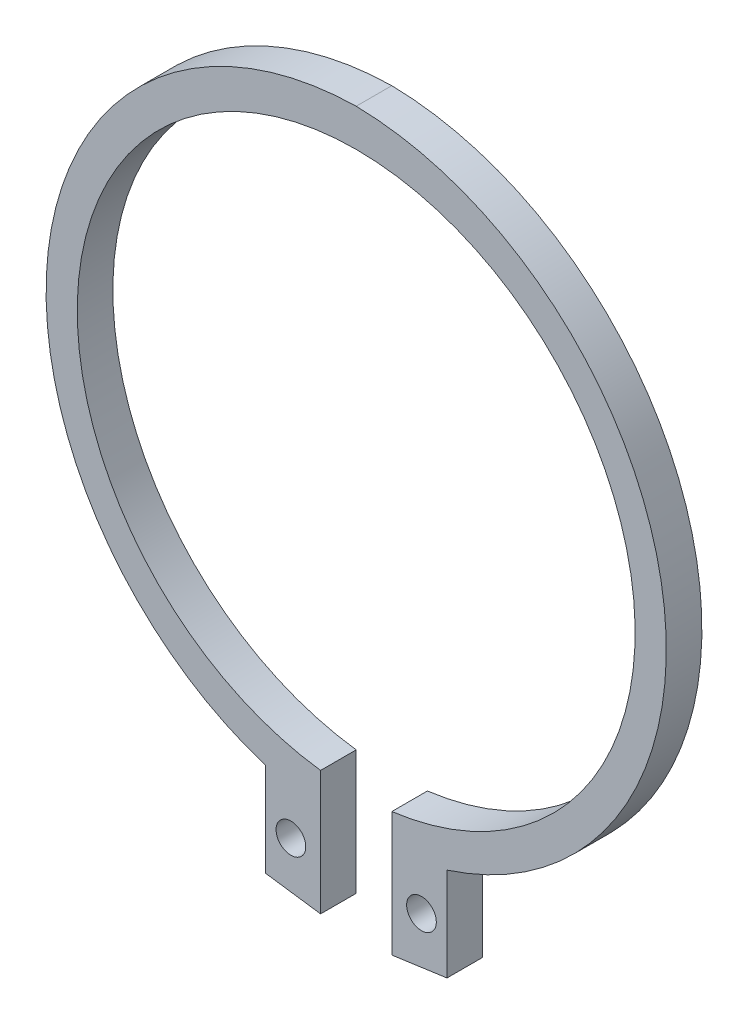
ISO-10303-21;
HEADER;
FILE_DESCRIPTION(('STEP AP214'),'2;1');
FILE_NAME('part.step','',(''),(''),'','','');
FILE_SCHEMA(('AUTOMOTIVE_DESIGN { 1 0 10303 214 1 1 1 1 }'));
ENDSEC;
DATA;
#1=APPLICATION_CONTEXT('core data for automotive mechanical design processes');
#2=APPLICATION_PROTOCOL_DEFINITION('international standard','automotive_design',2000,#1);
#3=PRODUCT_CONTEXT('',#1,'mechanical');
#4=PRODUCT('Part','Part','',(#3));
#5=PRODUCT_RELATED_PRODUCT_CATEGORY('part','',(#4));
#6=PRODUCT_DEFINITION_FORMATION('','',#4);
#7=PRODUCT_DEFINITION_CONTEXT('part definition',#1,'design');
#8=PRODUCT_DEFINITION('design','',#6,#7);
#9=PRODUCT_DEFINITION_SHAPE('','',#8);
#10=(LENGTH_UNIT() NAMED_UNIT(*) SI_UNIT(.MILLI.,.METRE.));
#11=(NAMED_UNIT(*) PLANE_ANGLE_UNIT() SI_UNIT($,.RADIAN.));
#12=(NAMED_UNIT(*) SI_UNIT($,.STERADIAN.) SOLID_ANGLE_UNIT());
#13=UNCERTAINTY_MEASURE_WITH_UNIT(LENGTH_MEASURE(1.E-05),#10,'distance_accuracy_value','');
#14=(GEOMETRIC_REPRESENTATION_CONTEXT(3) GLOBAL_UNCERTAINTY_ASSIGNED_CONTEXT((#13)) GLOBAL_UNIT_ASSIGNED_CONTEXT((#10,
#11,#12)) REPRESENTATION_CONTEXT('',''));
#15=CARTESIAN_POINT('',(0.,0.,0.));
#16=DIRECTION('',(0.,0.,1.));
#17=DIRECTION('',(1.,0.,0.));
#18=AXIS2_PLACEMENT_3D('',#15,#16,#17);
#19=CARTESIAN_POINT('',(5.5,-29.5,1.5));
#20=DIRECTION('',(0.,0.,-1.));
#21=DIRECTION('',(1.,0.,0.));
#22=AXIS2_PLACEMENT_3D('',#19,#20,#21);
#23=CYLINDRICAL_SURFACE('',#22,1.25);
#24=CARTESIAN_POINT('',(5.5,-29.5,0.));
#25=DIRECTION('',(0.,0.,1.));
#26=DIRECTION('',(1.,0.,0.));
#27=AXIS2_PLACEMENT_3D('',#24,#25,#26);
#28=CIRCLE('',#27,1.25);
#29=CARTESIAN_POINT('',(6.75,-29.5,0.));
#30=VERTEX_POINT('',#29);
#31=EDGE_CURVE('E33',#30,#30,#28,.T.);
#32=ORIENTED_EDGE('',*,*,#31,.F.);
#33=EDGE_LOOP('',(#32));
#34=FACE_BOUND('',#33,.T.);
#35=CARTESIAN_POINT('',(5.5,-29.5,3.));
#36=DIRECTION('',(0.,0.,-1.));
#37=DIRECTION('',(1.,0.,0.));
#38=AXIS2_PLACEMENT_3D('',#35,#36,#37);
#39=CIRCLE('',#38,1.25);
#40=CARTESIAN_POINT('',(6.75,-29.5,3.));
#41=VERTEX_POINT('',#40);
#42=EDGE_CURVE('E137',#41,#41,#39,.T.);
#43=ORIENTED_EDGE('',*,*,#42,.F.);
#44=EDGE_LOOP('',(#43));
#45=FACE_BOUND('',#44,.T.);
#46=ADVANCED_FACE('F16',(#34,#45),#23,.F.);
#47=CARTESIAN_POINT('',(-5.5,-29.5,1.5));
#48=DIRECTION('',(0.,0.,-1.));
#49=DIRECTION('',(1.,0.,0.));
#50=AXIS2_PLACEMENT_3D('',#47,#48,#49);
#51=CYLINDRICAL_SURFACE('',#50,1.25);
#52=CARTESIAN_POINT('',(-5.5,-29.5,0.));
#53=DIRECTION('',(0.,0.,1.));
#54=DIRECTION('',(1.,0.,0.));
#55=AXIS2_PLACEMENT_3D('',#52,#53,#54);
#56=CIRCLE('',#55,1.25);
#57=CARTESIAN_POINT('',(-4.25,-29.5,0.));
#58=VERTEX_POINT('',#57);
#59=EDGE_CURVE('E165',#58,#58,#56,.T.);
#60=ORIENTED_EDGE('',*,*,#59,.F.);
#61=EDGE_LOOP('',(#60));
#62=FACE_BOUND('',#61,.T.);
#63=CARTESIAN_POINT('',(-5.5,-29.5,3.));
#64=DIRECTION('',(0.,0.,-1.));
#65=DIRECTION('',(1.,0.,0.));
#66=AXIS2_PLACEMENT_3D('',#63,#64,#65);
#67=CIRCLE('',#66,1.25);
#68=CARTESIAN_POINT('',(-4.25,-29.5,3.));
#69=VERTEX_POINT('',#68);
#70=EDGE_CURVE('E134',#69,#69,#67,.T.);
#71=ORIENTED_EDGE('',*,*,#70,.F.);
#72=EDGE_LOOP('',(#71));
#73=FACE_BOUND('',#72,.T.);
#74=ADVANCED_FACE('F206',(#62,#73),#51,.F.);
#75=CARTESIAN_POINT('',(3.,-20.,1.5));
#76=DIRECTION('',(-1.,0.,0.));
#77=DIRECTION('',(0.,0.,1.));
#78=AXIS2_PLACEMENT_3D('',#75,#76,#77);
#79=PLANE('',#78);
#80=DIRECTION('',(0.,0.,-1.));
#81=VECTOR('',#80,1.);
#82=CARTESIAN_POINT('',(3.,-33.7776630717653,2.25));
#83=LINE('',#82,#81);
#84=CARTESIAN_POINT('',(3.,-33.7776630717653,3.));
#85=VERTEX_POINT('',#84);
#86=CARTESIAN_POINT('',(3.,-33.7776630717653,0.));
#87=VERTEX_POINT('',#86);
#88=EDGE_CURVE('E11',#85,#87,#83,.T.);
#89=ORIENTED_EDGE('',*,*,#88,.F.);
#90=DIRECTION('',(0.,-1.,0.));
#91=VECTOR('',#90,1.);
#92=CARTESIAN_POINT('',(3.,-11.1645296240594,3.));
#93=LINE('',#92,#91);
#94=CARTESIAN_POINT('',(3.,-23.3077240416134,3.));
#95=VERTEX_POINT('',#94);
#96=EDGE_CURVE('E71',#95,#85,#93,.T.);
#97=ORIENTED_EDGE('',*,*,#96,.F.);
#98=DIRECTION('',(0.,0.,1.));
#99=VECTOR('',#98,1.);
#100=CARTESIAN_POINT('',(3.,-23.3077240416134,1.5));
#101=LINE('',#100,#99);
#102=CARTESIAN_POINT('',(3.,-23.3077240416134,0.));
#103=VERTEX_POINT('',#102);
#104=EDGE_CURVE('E76',#103,#95,#101,.T.);
#105=ORIENTED_EDGE('',*,*,#104,.F.);
#106=DIRECTION('',(0.,1.,0.));
#107=VECTOR('',#106,1.);
#108=CARTESIAN_POINT('',(3.,-11.1645296240594,0.));
#109=LINE('',#108,#107);
#110=EDGE_CURVE('E113',#87,#103,#109,.T.);
#111=ORIENTED_EDGE('',*,*,#110,.F.);
#112=EDGE_LOOP('',(#89,#97,#105,#111));
#113=FACE_BOUND('',#112,.T.);
#114=ADVANCED_FACE('F220',(#113),#79,.T.);
#115=CARTESIAN_POINT('',(-3.,-20.,1.5));
#116=DIRECTION('',(1.,0.,0.));
#117=DIRECTION('',(0.,0.,-1.));
#118=AXIS2_PLACEMENT_3D('',#115,#116,#117);
#119=PLANE('',#118);
#120=DIRECTION('',(0.,0.,1.));
#121=VECTOR('',#120,1.);
#122=CARTESIAN_POINT('',(-3.,-33.7776630717653,0.75));
#123=LINE('',#122,#121);
#124=CARTESIAN_POINT('',(-3.,-33.7776630717653,0.));
#125=VERTEX_POINT('',#124);
#126=CARTESIAN_POINT('',(-3.,-33.7776630717653,3.));
#127=VERTEX_POINT('',#126);
#128=EDGE_CURVE('E109',#125,#127,#123,.T.);
#129=ORIENTED_EDGE('',*,*,#128,.F.);
#130=DIRECTION('',(0.,-1.,0.));
#131=VECTOR('',#130,1.);
#132=CARTESIAN_POINT('',(-3.,-11.1645296240594,0.));
#133=LINE('',#132,#131);
#134=CARTESIAN_POINT('',(-3.,-23.3077240416134,0.));
#135=VERTEX_POINT('',#134);
#136=EDGE_CURVE('E106',#135,#125,#133,.T.);
#137=ORIENTED_EDGE('',*,*,#136,.F.);
#138=DIRECTION('',(0.,0.,-1.));
#139=VECTOR('',#138,1.);
#140=CARTESIAN_POINT('',(-3.,-23.3077240416134,1.5));
#141=LINE('',#140,#139);
#142=CARTESIAN_POINT('',(-3.,-23.3077240416134,3.));
#143=VERTEX_POINT('',#142);
#144=EDGE_CURVE('E95',#143,#135,#141,.T.);
#145=ORIENTED_EDGE('',*,*,#144,.F.);
#146=DIRECTION('',(0.,1.,0.));
#147=VECTOR('',#146,1.);
#148=CARTESIAN_POINT('',(-3.,-11.1645296240594,3.));
#149=LINE('',#148,#147);
#150=EDGE_CURVE('E131',#127,#143,#149,.T.);
#151=ORIENTED_EDGE('',*,*,#150,.F.);
#152=EDGE_LOOP('',(#129,#137,#145,#151));
#153=FACE_BOUND('',#152,.T.);
#154=ADVANCED_FACE('F107',(#153),#119,.T.);
#155=CARTESIAN_POINT('',(4.84824790113069,-33.519578803927,3.));
#156=DIRECTION('',(0.138295484788931,-0.990391013129155,0.));
#157=DIRECTION('',(-0.990391013129155,-0.138295484788931,0.));
#158=AXIS2_PLACEMENT_3D('',#155,#156,#157);
#159=PLANE('',#158);
#160=ORIENTED_EDGE('',*,*,#88,.T.);
#161=DIRECTION('',(0.990391013129155,0.138295484788931,0.));
#162=VECTOR('',#161,1.);
#163=CARTESIAN_POINT('',(7.6483358476914,-33.128582202698,0.));
#164=LINE('',#163,#162);
#165=CARTESIAN_POINT('',(7.6483358476914,-33.128582202698,0.));
#166=VERTEX_POINT('',#165);
#167=EDGE_CURVE('E26',#87,#166,#164,.T.);
#168=ORIENTED_EDGE('',*,*,#167,.T.);
#169=DIRECTION('',(0.,0.,-1.));
#170=VECTOR('',#169,1.);
#171=CARTESIAN_POINT('',(7.6483358476914,-33.128582202698,3.));
#172=LINE('',#171,#170);
#173=CARTESIAN_POINT('',(7.6483358476914,-33.128582202698,3.));
#174=VERTEX_POINT('',#173);
#175=EDGE_CURVE('E155',#174,#166,#172,.T.);
#176=ORIENTED_EDGE('',*,*,#175,.F.);
#177=DIRECTION('',(-0.990391013129155,-0.138295484788931,0.));
#178=VECTOR('',#177,1.);
#179=CARTESIAN_POINT('',(7.6483358476914,-33.128582202698,3.));
#180=LINE('',#179,#178);
#181=EDGE_CURVE('E127',#174,#85,#180,.T.);
#182=ORIENTED_EDGE('',*,*,#181,.T.);
#183=EDGE_LOOP('',(#160,#168,#176,#182));
#184=FACE_BOUND('',#183,.T.);
#185=ADVANCED_FACE('F187',(#184),#159,.T.);
#186=CARTESIAN_POINT('',(-13.528773454714,-2.32905924811885,0.));
#187=DIRECTION('',(0.,0.,1.));
#188=DIRECTION('',(1.,0.,0.));
#189=AXIS2_PLACEMENT_3D('',#186,#187,#188);
#190=PLANE('',#189);
#191=ORIENTED_EDGE('',*,*,#31,.T.);
#192=EDGE_LOOP('',(#191));
#193=FACE_BOUND('',#192,.T.);
#194=ORIENTED_EDGE('',*,*,#59,.T.);
#195=EDGE_LOOP('',(#194));
#196=FACE_BOUND('',#195,.T.);
#197=ORIENTED_EDGE('',*,*,#110,.T.);
#198=CARTESIAN_POINT('',(0.,0.,0.));
#199=DIRECTION('',(0.,0.,-1.));
#200=DIRECTION('',(-1.,0.,0.));
#201=AXIS2_PLACEMENT_3D('',#198,#199,#200);
#202=CIRCLE('',#201,23.5);
#203=EDGE_CURVE('E99',#135,#103,#202,.T.);
#204=ORIENTED_EDGE('',*,*,#203,.F.);
#205=ORIENTED_EDGE('',*,*,#136,.T.);
#206=DIRECTION('',(0.990391013129155,-0.138295484788931,0.));
#207=VECTOR('',#206,1.);
#208=CARTESIAN_POINT('',(-7.6483358476914,-33.128582202698,0.));
#209=LINE('',#208,#207);
#210=CARTESIAN_POINT('',(-7.6483358476914,-33.128582202698,0.));
#211=VERTEX_POINT('',#210);
#212=EDGE_CURVE('E170',#211,#125,#209,.T.);
#213=ORIENTED_EDGE('',*,*,#212,.F.);
#214=DIRECTION('',(0.,1.,0.));
#215=VECTOR('',#214,1.);
#216=CARTESIAN_POINT('',(-7.6483358476914,-33.128582202698,0.));
#217=LINE('',#216,#215);
#218=CARTESIAN_POINT('',(-7.6483358476914,-25.253582202698,0.));
#219=VERTEX_POINT('',#218);
#220=EDGE_CURVE('E114',#211,#219,#217,.T.);
#221=ORIENTED_EDGE('',*,*,#220,.T.);
#222=CARTESIAN_POINT('',(0.462379837343679,0.0665577579510838,0.));
#223=DIRECTION('',(0.,0.,1.));
#224=DIRECTION('',(1.,0.,0.));
#225=AXIS2_PLACEMENT_3D('',#222,#223,#224);
#226=CIRCLE('',#225,26.5874631461961);
#227=CARTESIAN_POINT('',(0.,26.65,0.));
#228=VERTEX_POINT('',#227);
#229=EDGE_CURVE('E130',#228,#219,#226,.T.);
#230=ORIENTED_EDGE('',*,*,#229,.F.);
#231=CARTESIAN_POINT('',(-0.462379837343678,0.0665577579510838,0.));
#232=DIRECTION('',(0.,0.,1.));
#233=DIRECTION('',(-1.,0.,0.));
#234=AXIS2_PLACEMENT_3D('',#231,#232,#233);
#235=CIRCLE('',#234,26.5874631461961);
#236=CARTESIAN_POINT('',(7.6483358476914,-25.253582202698,0.));
#237=VERTEX_POINT('',#236);
#238=EDGE_CURVE('E140',#237,#228,#235,.T.);
#239=ORIENTED_EDGE('',*,*,#238,.F.);
#240=DIRECTION('',(0.,1.,0.));
#241=VECTOR('',#240,1.);
#242=CARTESIAN_POINT('',(7.6483358476914,-33.128582202698,0.));
#243=LINE('',#242,#241);
#244=EDGE_CURVE('E20',#166,#237,#243,.T.);
#245=ORIENTED_EDGE('',*,*,#244,.F.);
#246=ORIENTED_EDGE('',*,*,#167,.F.);
#247=EDGE_LOOP('',(#197,#204,#205,#213,#221,#230,#239,#245,#246));
#248=FACE_BOUND('',#247,.T.);
#249=ADVANCED_FACE('F116',(#193,#196,#248),#190,.F.);
#250=CARTESIAN_POINT('',(-0.462379837343679,0.0665577579510838,3.));
#251=DIRECTION('',(0.,0.,1.));
#252=DIRECTION('',(-1.,0.,0.));
#253=AXIS2_PLACEMENT_3D('',#250,#251,#252);
#254=CYLINDRICAL_SURFACE('',#253,26.5874631461961);
#255=ORIENTED_EDGE('',*,*,#238,.T.);
#256=DIRECTION('',(0.,0.,1.));
#257=VECTOR('',#256,1.);
#258=CARTESIAN_POINT('',(0.,26.65,0.));
#259=LINE('',#258,#257);
#260=CARTESIAN_POINT('',(0.,26.65,3.));
#261=VERTEX_POINT('',#260);
#262=EDGE_CURVE('E138',#228,#261,#259,.T.);
#263=ORIENTED_EDGE('',*,*,#262,.T.);
#264=CARTESIAN_POINT('',(-0.462379837343679,0.0665577579510838,3.));
#265=DIRECTION('',(0.,0.,-1.));
#266=DIRECTION('',(-1.,0.,0.));
#267=AXIS2_PLACEMENT_3D('',#264,#265,#266);
#268=CIRCLE('',#267,26.5874631461961);
#269=CARTESIAN_POINT('',(7.6483358476914,-25.253582202698,3.));
#270=VERTEX_POINT('',#269);
#271=EDGE_CURVE('E141',#261,#270,#268,.T.);
#272=ORIENTED_EDGE('',*,*,#271,.T.);
#273=DIRECTION('',(0.,0.,-1.));
#274=VECTOR('',#273,1.);
#275=CARTESIAN_POINT('',(7.6483358476914,-25.253582202698,3.));
#276=LINE('',#275,#274);
#277=EDGE_CURVE('E179',#270,#237,#276,.T.);
#278=ORIENTED_EDGE('',*,*,#277,.T.);
#279=EDGE_LOOP('',(#255,#263,#272,#278));
#280=FACE_BOUND('',#279,.T.);
#281=ADVANCED_FACE('F195',(#280),#254,.T.);
#282=CARTESIAN_POINT('',(7.6483358476914,-29.191082202698,3.));
#283=DIRECTION('',(1.,0.,0.));
#284=DIRECTION('',(0.,-1.,0.));
#285=AXIS2_PLACEMENT_3D('',#282,#283,#284);
#286=PLANE('',#285);
#287=ORIENTED_EDGE('',*,*,#244,.T.);
#288=ORIENTED_EDGE('',*,*,#277,.F.);
#289=DIRECTION('',(0.,1.,0.));
#290=VECTOR('',#289,1.);
#291=CARTESIAN_POINT('',(7.6483358476914,-33.128582202698,3.));
#292=LINE('',#291,#290);
#293=EDGE_CURVE('E133',#174,#270,#292,.T.);
#294=ORIENTED_EDGE('',*,*,#293,.F.);
#295=ORIENTED_EDGE('',*,*,#175,.T.);
#296=EDGE_LOOP('',(#287,#288,#294,#295));
#297=FACE_BOUND('',#296,.T.);
#298=ADVANCED_FACE('F193',(#297),#286,.T.);
#299=CARTESIAN_POINT('',(0.462379837343679,0.0665577579510838,0.));
#300=DIRECTION('',(0.,0.,-1.));
#301=DIRECTION('',(1.,0.,0.));
#302=AXIS2_PLACEMENT_3D('',#299,#300,#301);
#303=CYLINDRICAL_SURFACE('',#302,26.5874631461961);
#304=CARTESIAN_POINT('',(0.462379837343679,0.0665577579510838,3.));
#305=DIRECTION('',(0.,0.,-1.));
#306=DIRECTION('',(1.,0.,0.));
#307=AXIS2_PLACEMENT_3D('',#304,#305,#306);
#308=CIRCLE('',#307,26.5874631461961);
#309=CARTESIAN_POINT('',(-7.6483358476914,-25.253582202698,3.));
#310=VERTEX_POINT('',#309);
#311=EDGE_CURVE('E153',#310,#261,#308,.T.);
#312=ORIENTED_EDGE('',*,*,#311,.T.);
#313=ORIENTED_EDGE('',*,*,#262,.F.);
#314=ORIENTED_EDGE('',*,*,#229,.T.);
#315=DIRECTION('',(0.,0.,1.));
#316=VECTOR('',#315,1.);
#317=CARTESIAN_POINT('',(-7.6483358476914,-25.253582202698,0.));
#318=LINE('',#317,#316);
#319=EDGE_CURVE('E128',#219,#310,#318,.T.);
#320=ORIENTED_EDGE('',*,*,#319,.T.);
#321=EDGE_LOOP('',(#312,#313,#314,#320));
#322=FACE_BOUND('',#321,.T.);
#323=ADVANCED_FACE('F229',(#322),#303,.T.);
#324=CARTESIAN_POINT('',(0.,0.,0.));
#325=DIRECTION('',(0.,0.,-1.));
#326=DIRECTION('',(1.,0.,0.));
#327=AXIS2_PLACEMENT_3D('',#324,#325,#326);
#328=CYLINDRICAL_SURFACE('',#327,23.5);
#329=ORIENTED_EDGE('',*,*,#104,.T.);
#330=CARTESIAN_POINT('',(0.,0.,3.));
#331=DIRECTION('',(0.,0.,-1.));
#332=DIRECTION('',(-1.,0.,0.));
#333=AXIS2_PLACEMENT_3D('',#330,#331,#332);
#334=CIRCLE('',#333,23.5);
#335=EDGE_CURVE('E101',#143,#95,#334,.T.);
#336=ORIENTED_EDGE('',*,*,#335,.F.);
#337=ORIENTED_EDGE('',*,*,#144,.T.);
#338=ORIENTED_EDGE('',*,*,#203,.T.);
#339=EDGE_LOOP('',(#329,#336,#337,#338));
#340=FACE_BOUND('',#339,.T.);
#341=ADVANCED_FACE('F97',(#340),#328,.F.);
#342=CARTESIAN_POINT('',(-4.84824790113069,-33.519578803927,0.));
#343=DIRECTION('',(-0.138295484788931,-0.990391013129155,0.));
#344=DIRECTION('',(0.990391013129155,-0.138295484788931,0.));
#345=AXIS2_PLACEMENT_3D('',#342,#343,#344);
#346=PLANE('',#345);
#347=ORIENTED_EDGE('',*,*,#128,.T.);
#348=DIRECTION('',(-0.990391013129155,0.138295484788931,0.));
#349=VECTOR('',#348,1.);
#350=CARTESIAN_POINT('',(-7.6483358476914,-33.128582202698,3.));
#351=LINE('',#350,#349);
#352=CARTESIAN_POINT('',(-7.6483358476914,-33.128582202698,3.));
#353=VERTEX_POINT('',#352);
#354=EDGE_CURVE('E119',#127,#353,#351,.T.);
#355=ORIENTED_EDGE('',*,*,#354,.T.);
#356=DIRECTION('',(0.,0.,1.));
#357=VECTOR('',#356,1.);
#358=CARTESIAN_POINT('',(-7.6483358476914,-33.128582202698,0.));
#359=LINE('',#358,#357);
#360=EDGE_CURVE('E123',#211,#353,#359,.T.);
#361=ORIENTED_EDGE('',*,*,#360,.F.);
#362=ORIENTED_EDGE('',*,*,#212,.T.);
#363=EDGE_LOOP('',(#347,#355,#361,#362));
#364=FACE_BOUND('',#363,.T.);
#365=ADVANCED_FACE('F201',(#364),#346,.T.);
#366=CARTESIAN_POINT('',(-7.6483358476914,-29.191082202698,0.));
#367=DIRECTION('',(-1.,0.,0.));
#368=DIRECTION('',(0.,-1.,0.));
#369=AXIS2_PLACEMENT_3D('',#366,#367,#368);
#370=PLANE('',#369);
#371=DIRECTION('',(0.,1.,0.));
#372=VECTOR('',#371,1.);
#373=CARTESIAN_POINT('',(-7.6483358476914,-33.128582202698,3.));
#374=LINE('',#373,#372);
#375=EDGE_CURVE('E168',#353,#310,#374,.T.);
#376=ORIENTED_EDGE('',*,*,#375,.T.);
#377=ORIENTED_EDGE('',*,*,#319,.F.);
#378=ORIENTED_EDGE('',*,*,#220,.F.);
#379=ORIENTED_EDGE('',*,*,#360,.T.);
#380=EDGE_LOOP('',(#376,#377,#378,#379));
#381=FACE_BOUND('',#380,.T.);
#382=ADVANCED_FACE('F18',(#381),#370,.T.);
#383=CARTESIAN_POINT('',(-13.528773454714,-2.32905924811885,3.));
#384=DIRECTION('',(0.,0.,1.));
#385=DIRECTION('',(1.,0.,0.));
#386=AXIS2_PLACEMENT_3D('',#383,#384,#385);
#387=PLANE('',#386);
#388=ORIENTED_EDGE('',*,*,#42,.T.);
#389=EDGE_LOOP('',(#388));
#390=FACE_BOUND('',#389,.T.);
#391=ORIENTED_EDGE('',*,*,#70,.T.);
#392=EDGE_LOOP('',(#391));
#393=FACE_BOUND('',#392,.T.);
#394=ORIENTED_EDGE('',*,*,#96,.T.);
#395=ORIENTED_EDGE('',*,*,#181,.F.);
#396=ORIENTED_EDGE('',*,*,#293,.T.);
#397=ORIENTED_EDGE('',*,*,#271,.F.);
#398=ORIENTED_EDGE('',*,*,#311,.F.);
#399=ORIENTED_EDGE('',*,*,#375,.F.);
#400=ORIENTED_EDGE('',*,*,#354,.F.);
#401=ORIENTED_EDGE('',*,*,#150,.T.);
#402=ORIENTED_EDGE('',*,*,#335,.T.);
#403=EDGE_LOOP('',(#394,#395,#396,#397,#398,#399,#400,#401,#402));
#404=FACE_BOUND('',#403,.T.);
#405=ADVANCED_FACE('F190',(#390,#393,#404),#387,.T.);
#406=CLOSED_SHELL('',(#46,#74,#114,#154,#185,#249,#281,#298,#323,#341,#365,#382,#405));
#407=MANIFOLD_SOLID_BREP('B1',#406);
#408=ADVANCED_BREP_SHAPE_REPRESENTATION('',(#18,#407),#14);
#409=SHAPE_DEFINITION_REPRESENTATION(#9,#408);
ENDSEC;
END-ISO-10303-21;
